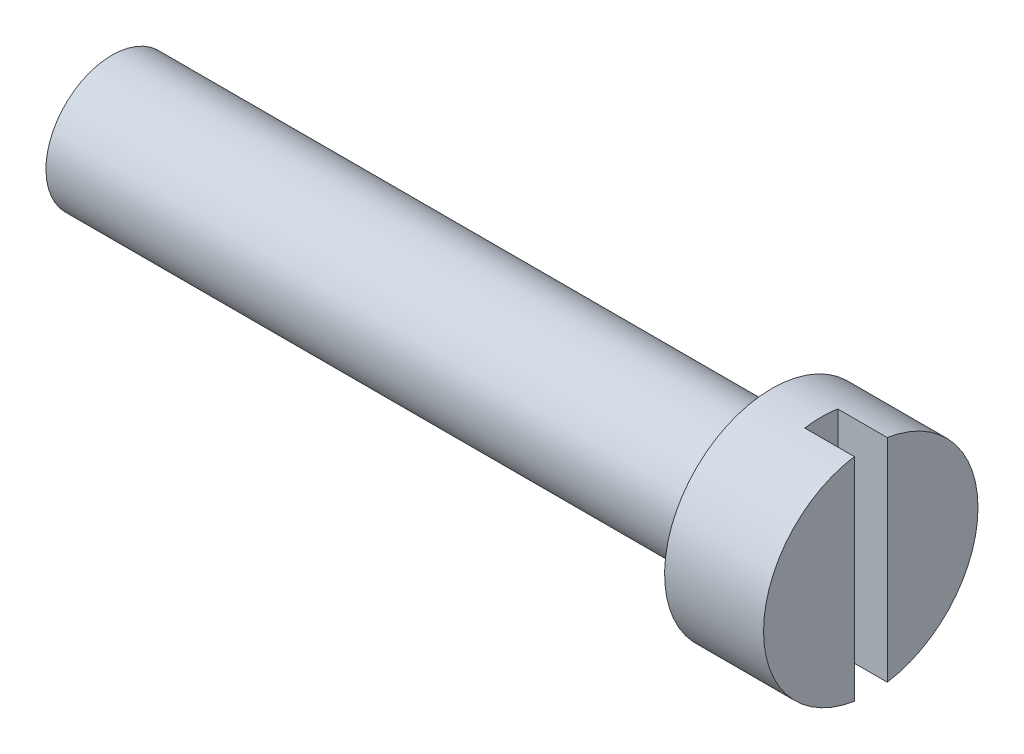
ISO-10303-21;
HEADER;
FILE_DESCRIPTION(('STEP AP214'),'2;1');
FILE_NAME('part.step','',(''),(''),'','','');
FILE_SCHEMA(('AUTOMOTIVE_DESIGN { 1 0 10303 214 1 1 1 1 }'));
ENDSEC;
DATA;
#1=APPLICATION_CONTEXT('core data for automotive mechanical design processes');
#2=APPLICATION_PROTOCOL_DEFINITION('international standard','automotive_design',2000,#1);
#3=PRODUCT_CONTEXT('',#1,'mechanical');
#4=PRODUCT('Part','Part','',(#3));
#5=PRODUCT_RELATED_PRODUCT_CATEGORY('part','',(#4));
#6=PRODUCT_DEFINITION_FORMATION('','',#4);
#7=PRODUCT_DEFINITION_CONTEXT('part definition',#1,'design');
#8=PRODUCT_DEFINITION('design','',#6,#7);
#9=PRODUCT_DEFINITION_SHAPE('','',#8);
#10=(LENGTH_UNIT() NAMED_UNIT(*) SI_UNIT(.MILLI.,.METRE.));
#11=(NAMED_UNIT(*) PLANE_ANGLE_UNIT() SI_UNIT($,.RADIAN.));
#12=(NAMED_UNIT(*) SI_UNIT($,.STERADIAN.) SOLID_ANGLE_UNIT());
#13=UNCERTAINTY_MEASURE_WITH_UNIT(LENGTH_MEASURE(1.E-05),#10,'distance_accuracy_value','');
#14=(GEOMETRIC_REPRESENTATION_CONTEXT(3) GLOBAL_UNCERTAINTY_ASSIGNED_CONTEXT((#13)) GLOBAL_UNIT_ASSIGNED_CONTEXT((#10,
#11,#12)) REPRESENTATION_CONTEXT('',''));
#15=CARTESIAN_POINT('',(0.,0.,0.));
#16=DIRECTION('',(0.,0.,1.));
#17=DIRECTION('',(1.,0.,0.));
#18=AXIS2_PLACEMENT_3D('',#15,#16,#17);
#19=CARTESIAN_POINT('',(0.,3.25,0.));
#20=DIRECTION('',(1.,0.,0.));
#21=DIRECTION('',(0.,1.,0.));
#22=AXIS2_PLACEMENT_3D('',#19,#20,#21);
#23=PLANE('',#22);
#24=DIRECTION('',(0.,1.,0.));
#25=VECTOR('',#24,1.);
#26=CARTESIAN_POINT('',(0.,-3.25,0.5));
#27=LINE('',#26,#25);
#28=CARTESIAN_POINT('',(0.,-3.21130814466628,0.5));
#29=VERTEX_POINT('',#28);
#30=CARTESIAN_POINT('',(0.,3.21130814466628,0.5));
#31=VERTEX_POINT('',#30);
#32=EDGE_CURVE('E97',#29,#31,#27,.T.);
#33=ORIENTED_EDGE('',*,*,#32,.T.);
#34=CARTESIAN_POINT('',(0.,0.,0.));
#35=DIRECTION('',(-1.,0.,0.));
#36=DIRECTION('',(0.,1.,0.));
#37=AXIS2_PLACEMENT_3D('',#34,#35,#36);
#38=CIRCLE('',#37,3.25);
#39=EDGE_CURVE('E87',#29,#31,#38,.T.);
#40=ORIENTED_EDGE('',*,*,#39,.F.);
#41=EDGE_LOOP('',(#33,#40));
#42=FACE_BOUND('',#41,.T.);
#43=ADVANCED_FACE('F43',(#42),#23,.T.);
#44=DIRECTION('',(0.,-1.,0.));
#45=VECTOR('',#44,1.);
#46=CARTESIAN_POINT('',(0.,-3.25,-0.5));
#47=LINE('',#46,#45);
#48=CARTESIAN_POINT('',(0.,3.21130814466628,-0.5));
#49=VERTEX_POINT('',#48);
#50=CARTESIAN_POINT('',(0.,-3.21130814466628,-0.5));
#51=VERTEX_POINT('',#50);
#52=EDGE_CURVE('E101',#49,#51,#47,.T.);
#53=ORIENTED_EDGE('',*,*,#52,.T.);
#54=EDGE_CURVE('E98',#49,#51,#38,.T.);
#55=ORIENTED_EDGE('',*,*,#54,.F.);
#56=EDGE_LOOP('',(#53,#55));
#57=FACE_BOUND('',#56,.T.);
#58=ADVANCED_FACE('F45',(#57),#23,.T.);
#59=CARTESIAN_POINT('',(-23.,0.,0.));
#60=DIRECTION('',(-1.,0.,0.));
#61=DIRECTION('',(0.,-1.,0.));
#62=AXIS2_PLACEMENT_3D('',#59,#60,#61);
#63=PLANE('',#62);
#64=CARTESIAN_POINT('',(-23.,0.,0.));
#65=DIRECTION('',(-1.,0.,0.));
#66=DIRECTION('',(0.,1.,0.));
#67=AXIS2_PLACEMENT_3D('',#64,#65,#66);
#68=CIRCLE('',#67,2.);
#69=CARTESIAN_POINT('',(-23.,2.,0.));
#70=VERTEX_POINT('',#69);
#71=EDGE_CURVE('E115',#70,#70,#68,.T.);
#72=ORIENTED_EDGE('',*,*,#71,.T.);
#73=EDGE_LOOP('',(#72));
#74=FACE_BOUND('',#73,.T.);
#75=ADVANCED_FACE('F127',(#74),#63,.T.);
#76=CARTESIAN_POINT('',(0.,0.,0.));
#77=DIRECTION('',(1.,0.,0.));
#78=DIRECTION('',(0.,1.,0.));
#79=AXIS2_PLACEMENT_3D('',#76,#77,#78);
#80=CYLINDRICAL_SURFACE('',#79,2.);
#81=ORIENTED_EDGE('',*,*,#71,.F.);
#82=EDGE_LOOP('',(#81));
#83=FACE_BOUND('',#82,.T.);
#84=CARTESIAN_POINT('',(-3.,0.,0.));
#85=DIRECTION('',(-1.,0.,0.));
#86=DIRECTION('',(0.,1.,0.));
#87=AXIS2_PLACEMENT_3D('',#84,#85,#86);
#88=CIRCLE('',#87,2.);
#89=CARTESIAN_POINT('',(-3.,2.,0.));
#90=VERTEX_POINT('',#89);
#91=EDGE_CURVE('E112',#90,#90,#88,.T.);
#92=ORIENTED_EDGE('',*,*,#91,.T.);
#93=EDGE_LOOP('',(#92));
#94=FACE_BOUND('',#93,.T.);
#95=ADVANCED_FACE('F132',(#83,#94),#80,.T.);
#96=CARTESIAN_POINT('',(-3.,2.,0.));
#97=DIRECTION('',(-1.,0.,0.));
#98=DIRECTION('',(0.,-1.,0.));
#99=AXIS2_PLACEMENT_3D('',#96,#97,#98);
#100=PLANE('',#99);
#101=ORIENTED_EDGE('',*,*,#91,.F.);
#102=EDGE_LOOP('',(#101));
#103=FACE_BOUND('',#102,.T.);
#104=CARTESIAN_POINT('',(-3.,0.,0.));
#105=DIRECTION('',(-1.,0.,0.));
#106=DIRECTION('',(0.,1.,0.));
#107=AXIS2_PLACEMENT_3D('',#104,#105,#106);
#108=CIRCLE('',#107,3.25);
#109=CARTESIAN_POINT('',(-3.,3.25,0.));
#110=VERTEX_POINT('',#109);
#111=EDGE_CURVE('E109',#110,#110,#108,.T.);
#112=ORIENTED_EDGE('',*,*,#111,.T.);
#113=EDGE_LOOP('',(#112));
#114=FACE_BOUND('',#113,.T.);
#115=ADVANCED_FACE('F156',(#103,#114),#100,.T.);
#116=CARTESIAN_POINT('',(0.,0.,0.));
#117=DIRECTION('',(1.,0.,0.));
#118=DIRECTION('',(0.,1.,0.));
#119=AXIS2_PLACEMENT_3D('',#116,#117,#118);
#120=CYLINDRICAL_SURFACE('',#119,3.25);
#121=DIRECTION('',(1.,0.,0.));
#122=VECTOR('',#121,1.);
#123=CARTESIAN_POINT('',(0.,3.21130814466628,0.5));
#124=LINE('',#123,#122);
#125=CARTESIAN_POINT('',(-1.5,3.21130814466628,0.5));
#126=VERTEX_POINT('',#125);
#127=EDGE_CURVE('E11',#31,#126,#124,.F.);
#128=ORIENTED_EDGE('',*,*,#127,.T.);
#129=CARTESIAN_POINT('',(-1.5,0.,0.));
#130=DIRECTION('',(1.,0.,0.));
#131=DIRECTION('',(0.,-1.,0.));
#132=AXIS2_PLACEMENT_3D('',#129,#130,#131);
#133=CIRCLE('',#132,3.25);
#134=CARTESIAN_POINT('',(-1.5,3.21130814466628,-0.5));
#135=VERTEX_POINT('',#134);
#136=EDGE_CURVE('E93',#126,#135,#133,.F.);
#137=ORIENTED_EDGE('',*,*,#136,.T.);
#138=DIRECTION('',(1.,0.,0.));
#139=VECTOR('',#138,1.);
#140=CARTESIAN_POINT('',(0.,3.21130814466628,-0.5));
#141=LINE('',#140,#139);
#142=EDGE_CURVE('E51',#135,#49,#141,.T.);
#143=ORIENTED_EDGE('',*,*,#142,.T.);
#144=ORIENTED_EDGE('',*,*,#54,.T.);
#145=DIRECTION('',(1.,0.,0.));
#146=VECTOR('',#145,1.);
#147=CARTESIAN_POINT('',(0.,-3.21130814466628,-0.5));
#148=LINE('',#147,#146);
#149=CARTESIAN_POINT('',(-1.5,-3.21130814466628,-0.5));
#150=VERTEX_POINT('',#149);
#151=EDGE_CURVE('E94',#51,#150,#148,.F.);
#152=ORIENTED_EDGE('',*,*,#151,.T.);
#153=CARTESIAN_POINT('',(-1.5,-3.21130814466628,0.5));
#154=VERTEX_POINT('',#153);
#155=EDGE_CURVE('E90',#150,#154,#133,.F.);
#156=ORIENTED_EDGE('',*,*,#155,.T.);
#157=DIRECTION('',(1.,0.,0.));
#158=VECTOR('',#157,1.);
#159=CARTESIAN_POINT('',(0.,-3.21130814466628,0.5));
#160=LINE('',#159,#158);
#161=EDGE_CURVE('E83',#154,#29,#160,.T.);
#162=ORIENTED_EDGE('',*,*,#161,.T.);
#163=ORIENTED_EDGE('',*,*,#39,.T.);
#164=EDGE_LOOP('',(#128,#137,#143,#144,#152,#156,#162,#163));
#165=FACE_BOUND('',#164,.T.);
#166=ORIENTED_EDGE('',*,*,#111,.F.);
#167=EDGE_LOOP('',(#166));
#168=FACE_BOUND('',#167,.T.);
#169=ADVANCED_FACE('F85',(#165,#168),#120,.T.);
#170=CARTESIAN_POINT('',(-1.5,-3.25,0.5));
#171=DIRECTION('',(0.,0.,1.));
#172=DIRECTION('',(-1.,0.,0.));
#173=AXIS2_PLACEMENT_3D('',#170,#171,#172);
#174=PLANE('',#173);
#175=ORIENTED_EDGE('',*,*,#127,.F.);
#176=ORIENTED_EDGE('',*,*,#32,.F.);
#177=ORIENTED_EDGE('',*,*,#161,.F.);
#178=DIRECTION('',(0.,1.,0.));
#179=VECTOR('',#178,1.);
#180=CARTESIAN_POINT('',(-1.5,-3.25,0.5));
#181=LINE('',#180,#179);
#182=EDGE_CURVE('E104',#154,#126,#181,.T.);
#183=ORIENTED_EDGE('',*,*,#182,.T.);
#184=EDGE_LOOP('',(#175,#176,#177,#183));
#185=FACE_BOUND('',#184,.T.);
#186=ADVANCED_FACE('F100',(#185),#174,.F.);
#187=CARTESIAN_POINT('',(-1.5,-3.25,-0.5));
#188=DIRECTION('',(0.,0.,-1.));
#189=DIRECTION('',(1.,0.,0.));
#190=AXIS2_PLACEMENT_3D('',#187,#188,#189);
#191=PLANE('',#190);
#192=ORIENTED_EDGE('',*,*,#151,.F.);
#193=ORIENTED_EDGE('',*,*,#52,.F.);
#194=ORIENTED_EDGE('',*,*,#142,.F.);
#195=DIRECTION('',(0.,-1.,0.));
#196=VECTOR('',#195,1.);
#197=CARTESIAN_POINT('',(-1.5,-3.25,-0.5));
#198=LINE('',#197,#196);
#199=EDGE_CURVE('E58',#135,#150,#198,.T.);
#200=ORIENTED_EDGE('',*,*,#199,.T.);
#201=EDGE_LOOP('',(#192,#193,#194,#200));
#202=FACE_BOUND('',#201,.T.);
#203=ADVANCED_FACE('F124',(#202),#191,.F.);
#204=CARTESIAN_POINT('',(-1.5,0.,0.));
#205=DIRECTION('',(-1.,0.,0.));
#206=DIRECTION('',(0.,-1.,0.));
#207=AXIS2_PLACEMENT_3D('',#204,#205,#206);
#208=PLANE('',#207);
#209=ORIENTED_EDGE('',*,*,#182,.F.);
#210=ORIENTED_EDGE('',*,*,#155,.F.);
#211=ORIENTED_EDGE('',*,*,#199,.F.);
#212=ORIENTED_EDGE('',*,*,#136,.F.);
#213=EDGE_LOOP('',(#209,#210,#211,#212));
#214=FACE_BOUND('',#213,.T.);
#215=ADVANCED_FACE('F122',(#214),#208,.F.);
#216=CLOSED_SHELL('',(#43,#58,#75,#95,#115,#169,#186,#203,#215));
#217=MANIFOLD_SOLID_BREP('B2',#216);
#218=ADVANCED_BREP_SHAPE_REPRESENTATION('',(#18,#217),#14);
#219=SHAPE_DEFINITION_REPRESENTATION(#9,#218);
ENDSEC;
END-ISO-10303-21;
